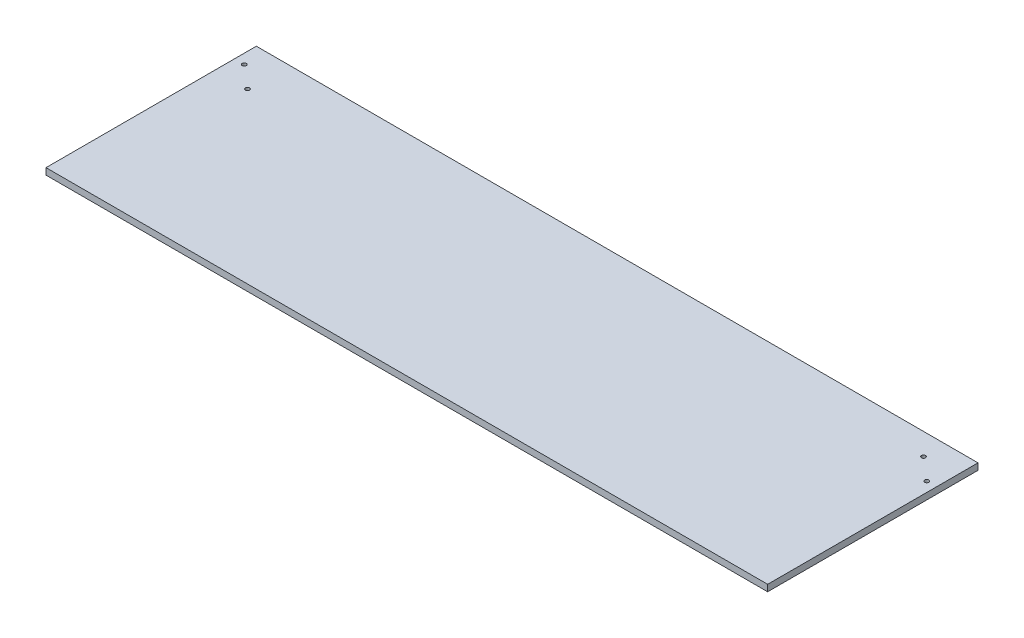
ISO-10303-21;
HEADER;
FILE_DESCRIPTION(('STEP AP214'),'2;1');
FILE_NAME('part.step','',(''),(''),'','','');
FILE_SCHEMA(('AUTOMOTIVE_DESIGN { 1 0 10303 214 1 1 1 1 }'));
ENDSEC;
DATA;
#1=APPLICATION_CONTEXT('core data for automotive mechanical design processes');
#2=APPLICATION_PROTOCOL_DEFINITION('international standard','automotive_design',2000,#1);
#3=PRODUCT_CONTEXT('',#1,'mechanical');
#4=PRODUCT('Part','Part','',(#3));
#5=PRODUCT_RELATED_PRODUCT_CATEGORY('part','',(#4));
#6=PRODUCT_DEFINITION_FORMATION('','',#4);
#7=PRODUCT_DEFINITION_CONTEXT('part definition',#1,'design');
#8=PRODUCT_DEFINITION('design','',#6,#7);
#9=PRODUCT_DEFINITION_SHAPE('','',#8);
#10=(LENGTH_UNIT() NAMED_UNIT(*) SI_UNIT(.MILLI.,.METRE.));
#11=(NAMED_UNIT(*) PLANE_ANGLE_UNIT() SI_UNIT($,.RADIAN.));
#12=(NAMED_UNIT(*) SI_UNIT($,.STERADIAN.) SOLID_ANGLE_UNIT());
#13=UNCERTAINTY_MEASURE_WITH_UNIT(LENGTH_MEASURE(1.E-05),#10,'distance_accuracy_value','');
#14=(GEOMETRIC_REPRESENTATION_CONTEXT(3) GLOBAL_UNCERTAINTY_ASSIGNED_CONTEXT((#13)) GLOBAL_UNIT_ASSIGNED_CONTEXT((#10,
#11,#12)) REPRESENTATION_CONTEXT('',''));
#15=CARTESIAN_POINT('',(0.,0.,0.));
#16=DIRECTION('',(0.,0.,1.));
#17=DIRECTION('',(1.,0.,0.));
#18=AXIS2_PLACEMENT_3D('',#15,#16,#17);
#19=CARTESIAN_POINT('',(0.,6.35,0.));
#20=DIRECTION('',(1.,0.,0.));
#21=DIRECTION('',(0.,0.,-1.));
#22=AXIS2_PLACEMENT_3D('',#19,#20,#21);
#23=PLANE('',#22);
#24=DIRECTION('',(0.,0.,1.));
#25=VECTOR('',#24,1.);
#26=CARTESIAN_POINT('',(0.,0.,0.));
#27=LINE('',#26,#25);
#28=CARTESIAN_POINT('',(0.,0.,-205.));
#29=VERTEX_POINT('',#28);
#30=CARTESIAN_POINT('',(0.,0.,0.));
#31=VERTEX_POINT('',#30);
#32=EDGE_CURVE('E98',#29,#31,#27,.T.);
#33=ORIENTED_EDGE('',*,*,#32,.T.);
#34=DIRECTION('',(0.,-1.,0.));
#35=VECTOR('',#34,1.);
#36=CARTESIAN_POINT('',(0.,6.35,0.));
#37=LINE('',#36,#35);
#38=CARTESIAN_POINT('',(0.,6.35,0.));
#39=VERTEX_POINT('',#38);
#40=EDGE_CURVE('E11',#39,#31,#37,.T.);
#41=ORIENTED_EDGE('',*,*,#40,.F.);
#42=DIRECTION('',(0.,0.,1.));
#43=VECTOR('',#42,1.);
#44=CARTESIAN_POINT('',(0.,6.35,0.));
#45=LINE('',#44,#43);
#46=CARTESIAN_POINT('',(0.,6.35,-205.));
#47=VERTEX_POINT('',#46);
#48=EDGE_CURVE('E85',#47,#39,#45,.T.);
#49=ORIENTED_EDGE('',*,*,#48,.F.);
#50=DIRECTION('',(0.,-1.,0.));
#51=VECTOR('',#50,1.);
#52=CARTESIAN_POINT('',(0.,6.35,-205.));
#53=LINE('',#52,#51);
#54=EDGE_CURVE('E94',#47,#29,#53,.T.);
#55=ORIENTED_EDGE('',*,*,#54,.T.);
#56=EDGE_LOOP('',(#33,#41,#49,#55));
#57=FACE_BOUND('',#56,.T.);
#58=ADVANCED_FACE('F33',(#57),#23,.F.);
#59=CARTESIAN_POINT('',(0.,6.35,0.));
#60=DIRECTION('',(0.,0.,-1.));
#61=DIRECTION('',(-1.,0.,0.));
#62=AXIS2_PLACEMENT_3D('',#59,#60,#61);
#63=PLANE('',#62);
#64=DIRECTION('',(1.,0.,0.));
#65=VECTOR('',#64,1.);
#66=CARTESIAN_POINT('',(0.,0.,0.));
#67=LINE('',#66,#65);
#68=CARTESIAN_POINT('',(703.33,0.,0.));
#69=VERTEX_POINT('',#68);
#70=EDGE_CURVE('E89',#31,#69,#67,.T.);
#71=ORIENTED_EDGE('',*,*,#70,.T.);
#72=DIRECTION('',(0.,-1.,0.));
#73=VECTOR('',#72,1.);
#74=CARTESIAN_POINT('',(703.33,6.35,0.));
#75=LINE('',#74,#73);
#76=CARTESIAN_POINT('',(703.33,6.35,0.));
#77=VERTEX_POINT('',#76);
#78=EDGE_CURVE('E42',#77,#69,#75,.T.);
#79=ORIENTED_EDGE('',*,*,#78,.F.);
#80=DIRECTION('',(1.,0.,0.));
#81=VECTOR('',#80,1.);
#82=CARTESIAN_POINT('',(0.,6.35,0.));
#83=LINE('',#82,#81);
#84=EDGE_CURVE('E80',#39,#77,#83,.T.);
#85=ORIENTED_EDGE('',*,*,#84,.F.);
#86=ORIENTED_EDGE('',*,*,#40,.T.);
#87=EDGE_LOOP('',(#71,#79,#85,#86));
#88=FACE_BOUND('',#87,.T.);
#89=ADVANCED_FACE('F88',(#88),#63,.F.);
#90=CARTESIAN_POINT('',(703.33,6.35,0.));
#91=DIRECTION('',(-1.,0.,0.));
#92=DIRECTION('',(0.,0.,1.));
#93=AXIS2_PLACEMENT_3D('',#90,#91,#92);
#94=PLANE('',#93);
#95=DIRECTION('',(0.,0.,-1.));
#96=VECTOR('',#95,1.);
#97=CARTESIAN_POINT('',(703.33,0.,0.));
#98=LINE('',#97,#96);
#99=CARTESIAN_POINT('',(703.33,0.,-205.));
#100=VERTEX_POINT('',#99);
#101=EDGE_CURVE('E67',#69,#100,#98,.T.);
#102=ORIENTED_EDGE('',*,*,#101,.T.);
#103=DIRECTION('',(0.,-1.,0.));
#104=VECTOR('',#103,1.);
#105=CARTESIAN_POINT('',(703.33,6.35,-205.));
#106=LINE('',#105,#104);
#107=CARTESIAN_POINT('',(703.33,6.35,-205.));
#108=VERTEX_POINT('',#107);
#109=EDGE_CURVE('E90',#108,#100,#106,.T.);
#110=ORIENTED_EDGE('',*,*,#109,.F.);
#111=DIRECTION('',(0.,0.,-1.));
#112=VECTOR('',#111,1.);
#113=CARTESIAN_POINT('',(703.33,6.35,0.));
#114=LINE('',#113,#112);
#115=EDGE_CURVE('E83',#77,#108,#114,.T.);
#116=ORIENTED_EDGE('',*,*,#115,.F.);
#117=ORIENTED_EDGE('',*,*,#78,.T.);
#118=EDGE_LOOP('',(#102,#110,#116,#117));
#119=FACE_BOUND('',#118,.T.);
#120=ADVANCED_FACE('F92',(#119),#94,.F.);
#121=CARTESIAN_POINT('',(0.,6.35,-205.));
#122=DIRECTION('',(0.,0.,1.));
#123=DIRECTION('',(1.,0.,0.));
#124=AXIS2_PLACEMENT_3D('',#121,#122,#123);
#125=PLANE('',#124);
#126=DIRECTION('',(-1.,0.,0.));
#127=VECTOR('',#126,1.);
#128=CARTESIAN_POINT('',(0.,0.,-205.));
#129=LINE('',#128,#127);
#130=EDGE_CURVE('E73',#100,#29,#129,.T.);
#131=ORIENTED_EDGE('',*,*,#130,.T.);
#132=ORIENTED_EDGE('',*,*,#54,.F.);
#133=DIRECTION('',(-1.,0.,0.));
#134=VECTOR('',#133,1.);
#135=CARTESIAN_POINT('',(0.,6.35,-205.));
#136=LINE('',#135,#134);
#137=EDGE_CURVE('E50',#108,#47,#136,.T.);
#138=ORIENTED_EDGE('',*,*,#137,.F.);
#139=ORIENTED_EDGE('',*,*,#109,.T.);
#140=EDGE_LOOP('',(#131,#132,#138,#139));
#141=FACE_BOUND('',#140,.T.);
#142=ADVANCED_FACE('F106',(#141),#125,.F.);
#143=CARTESIAN_POINT('',(0.,6.35,0.));
#144=DIRECTION('',(0.,-1.,0.));
#145=DIRECTION('',(0.,0.,-1.));
#146=AXIS2_PLACEMENT_3D('',#143,#144,#145);
#147=PLANE('',#146);
#148=CARTESIAN_POINT('',(693.805,6.34999999999986,-164.6));
#149=DIRECTION('',(0.,1.,0.));
#150=DIRECTION('',(0.,0.,1.));
#151=AXIS2_PLACEMENT_3D('',#148,#149,#150);
#152=CIRCLE('',#151,2.);
#153=CARTESIAN_POINT('',(693.805,6.34999999999986,-162.6));
#154=VERTEX_POINT('',#153);
#155=EDGE_CURVE('E129',#154,#154,#152,.T.);
#156=ORIENTED_EDGE('',*,*,#155,.F.);
#157=EDGE_LOOP('',(#156));
#158=FACE_BOUND('',#157,.T.);
#159=CARTESIAN_POINT('',(671.58,6.34999999999986,-183.65));
#160=DIRECTION('',(0.,1.,0.));
#161=DIRECTION('',(0.,0.,1.));
#162=AXIS2_PLACEMENT_3D('',#159,#160,#161);
#163=CIRCLE('',#162,2.);
#164=CARTESIAN_POINT('',(671.58,6.34999999999986,-181.65));
#165=VERTEX_POINT('',#164);
#166=EDGE_CURVE('E123',#165,#165,#163,.T.);
#167=ORIENTED_EDGE('',*,*,#166,.F.);
#168=EDGE_LOOP('',(#167));
#169=FACE_BOUND('',#168,.T.);
#170=CARTESIAN_POINT('',(31.754596215561,6.34999999999986,-164.6));
#171=DIRECTION('',(0.,1.,0.));
#172=DIRECTION('',(0.,0.,1.));
#173=AXIS2_PLACEMENT_3D('',#170,#171,#172);
#174=CIRCLE('',#173,1.99999999999999);
#175=CARTESIAN_POINT('',(31.754596215561,6.34999999999986,-162.6));
#176=VERTEX_POINT('',#175);
#177=EDGE_CURVE('E120',#176,#176,#174,.T.);
#178=ORIENTED_EDGE('',*,*,#177,.F.);
#179=EDGE_LOOP('',(#178));
#180=FACE_BOUND('',#179,.T.);
#181=CARTESIAN_POINT('',(9.52959621556099,6.34999999999986,-183.65));
#182=DIRECTION('',(0.,1.,0.));
#183=DIRECTION('',(0.,0.,1.));
#184=AXIS2_PLACEMENT_3D('',#181,#182,#183);
#185=CIRCLE('',#184,1.99999999999999);
#186=CARTESIAN_POINT('',(9.52959621556099,6.34999999999986,-181.65));
#187=VERTEX_POINT('',#186);
#188=EDGE_CURVE('E114',#187,#187,#185,.T.);
#189=ORIENTED_EDGE('',*,*,#188,.F.);
#190=EDGE_LOOP('',(#189));
#191=FACE_BOUND('',#190,.T.);
#192=ORIENTED_EDGE('',*,*,#48,.T.);
#193=ORIENTED_EDGE('',*,*,#84,.T.);
#194=ORIENTED_EDGE('',*,*,#115,.T.);
#195=ORIENTED_EDGE('',*,*,#137,.T.);
#196=EDGE_LOOP('',(#192,#193,#194,#195));
#197=FACE_BOUND('',#196,.T.);
#198=ADVANCED_FACE('F81',(#158,#169,#180,#191,#197),#147,.F.);
#199=CARTESIAN_POINT('',(0.,0.,0.));
#200=DIRECTION('',(0.,-1.,0.));
#201=DIRECTION('',(0.,0.,-1.));
#202=AXIS2_PLACEMENT_3D('',#199,#200,#201);
#203=PLANE('',#202);
#204=CARTESIAN_POINT('',(693.805,0.,-164.6));
#205=DIRECTION('',(0.,-1.,0.));
#206=DIRECTION('',(0.,0.,-1.));
#207=AXIS2_PLACEMENT_3D('',#204,#205,#206);
#208=CIRCLE('',#207,2.);
#209=CARTESIAN_POINT('',(693.805,0.,-166.6));
#210=VERTEX_POINT('',#209);
#211=EDGE_CURVE('E126',#210,#210,#208,.T.);
#212=ORIENTED_EDGE('',*,*,#211,.F.);
#213=EDGE_LOOP('',(#212));
#214=FACE_BOUND('',#213,.T.);
#215=CARTESIAN_POINT('',(671.58,0.,-183.65));
#216=DIRECTION('',(0.,-1.,0.));
#217=DIRECTION('',(0.,0.,-1.));
#218=AXIS2_PLACEMENT_3D('',#215,#216,#217);
#219=CIRCLE('',#218,2.);
#220=CARTESIAN_POINT('',(671.58,0.,-185.65));
#221=VERTEX_POINT('',#220);
#222=EDGE_CURVE('E36',#221,#221,#219,.T.);
#223=ORIENTED_EDGE('',*,*,#222,.F.);
#224=EDGE_LOOP('',(#223));
#225=FACE_BOUND('',#224,.T.);
#226=CARTESIAN_POINT('',(31.754596215561,0.,-164.6));
#227=DIRECTION('',(0.,-1.,0.));
#228=DIRECTION('',(0.,0.,-1.));
#229=AXIS2_PLACEMENT_3D('',#226,#227,#228);
#230=CIRCLE('',#229,1.99999999999999);
#231=CARTESIAN_POINT('',(31.754596215561,0.,-166.6));
#232=VERTEX_POINT('',#231);
#233=EDGE_CURVE('E117',#232,#232,#230,.T.);
#234=ORIENTED_EDGE('',*,*,#233,.F.);
#235=EDGE_LOOP('',(#234));
#236=FACE_BOUND('',#235,.T.);
#237=CARTESIAN_POINT('',(9.52959621556099,0.,-183.65));
#238=DIRECTION('',(0.,-1.,0.));
#239=DIRECTION('',(0.,0.,-1.));
#240=AXIS2_PLACEMENT_3D('',#237,#238,#239);
#241=CIRCLE('',#240,1.99999999999999);
#242=CARTESIAN_POINT('',(9.52959621556099,0.,-185.65));
#243=VERTEX_POINT('',#242);
#244=EDGE_CURVE('E101',#243,#243,#241,.T.);
#245=ORIENTED_EDGE('',*,*,#244,.F.);
#246=EDGE_LOOP('',(#245));
#247=FACE_BOUND('',#246,.T.);
#248=ORIENTED_EDGE('',*,*,#32,.F.);
#249=ORIENTED_EDGE('',*,*,#130,.F.);
#250=ORIENTED_EDGE('',*,*,#101,.F.);
#251=ORIENTED_EDGE('',*,*,#70,.F.);
#252=EDGE_LOOP('',(#248,#249,#250,#251));
#253=FACE_BOUND('',#252,.T.);
#254=ADVANCED_FACE('F109',(#214,#225,#236,#247,#253),#203,.T.);
#255=CARTESIAN_POINT('',(9.52959621556099,6.34999999999986,-183.65));
#256=DIRECTION('',(0.,1.,0.));
#257=DIRECTION('',(0.,0.,1.));
#258=AXIS2_PLACEMENT_3D('',#255,#256,#257);
#259=CYLINDRICAL_SURFACE('',#258,1.99999999999999);
#260=ORIENTED_EDGE('',*,*,#244,.T.);
#261=EDGE_LOOP('',(#260));
#262=FACE_BOUND('',#261,.T.);
#263=ORIENTED_EDGE('',*,*,#188,.T.);
#264=EDGE_LOOP('',(#263));
#265=FACE_BOUND('',#264,.T.);
#266=ADVANCED_FACE('F144',(#262,#265),#259,.F.);
#267=CARTESIAN_POINT('',(31.754596215561,6.34999999999986,-164.6));
#268=DIRECTION('',(0.,1.,0.));
#269=DIRECTION('',(0.,0.,1.));
#270=AXIS2_PLACEMENT_3D('',#267,#268,#269);
#271=CYLINDRICAL_SURFACE('',#270,1.99999999999999);
#272=ORIENTED_EDGE('',*,*,#233,.T.);
#273=EDGE_LOOP('',(#272));
#274=FACE_BOUND('',#273,.T.);
#275=ORIENTED_EDGE('',*,*,#177,.T.);
#276=EDGE_LOOP('',(#275));
#277=FACE_BOUND('',#276,.T.);
#278=ADVANCED_FACE('F146',(#274,#277),#271,.F.);
#279=CARTESIAN_POINT('',(671.58,6.34999999999986,-183.65));
#280=DIRECTION('',(0.,1.,0.));
#281=DIRECTION('',(0.,0.,1.));
#282=AXIS2_PLACEMENT_3D('',#279,#280,#281);
#283=CYLINDRICAL_SURFACE('',#282,2.);
#284=ORIENTED_EDGE('',*,*,#222,.T.);
#285=EDGE_LOOP('',(#284));
#286=FACE_BOUND('',#285,.T.);
#287=ORIENTED_EDGE('',*,*,#166,.T.);
#288=EDGE_LOOP('',(#287));
#289=FACE_BOUND('',#288,.T.);
#290=ADVANCED_FACE('F153',(#286,#289),#283,.F.);
#291=CARTESIAN_POINT('',(693.805,6.34999999999986,-164.6));
#292=DIRECTION('',(0.,1.,0.));
#293=DIRECTION('',(0.,0.,1.));
#294=AXIS2_PLACEMENT_3D('',#291,#292,#293);
#295=CYLINDRICAL_SURFACE('',#294,2.);
#296=ORIENTED_EDGE('',*,*,#211,.T.);
#297=EDGE_LOOP('',(#296));
#298=FACE_BOUND('',#297,.T.);
#299=ORIENTED_EDGE('',*,*,#155,.T.);
#300=EDGE_LOOP('',(#299));
#301=FACE_BOUND('',#300,.T.);
#302=ADVANCED_FACE('F133',(#298,#301),#295,.F.);
#303=CLOSED_SHELL('',(#58,#89,#120,#142,#198,#254,#266,#278,#290,#302));
#304=MANIFOLD_SOLID_BREP('B2',#303);
#305=ADVANCED_BREP_SHAPE_REPRESENTATION('',(#18,#304),#14);
#306=SHAPE_DEFINITION_REPRESENTATION(#9,#305);
ENDSEC;
END-ISO-10303-21;
